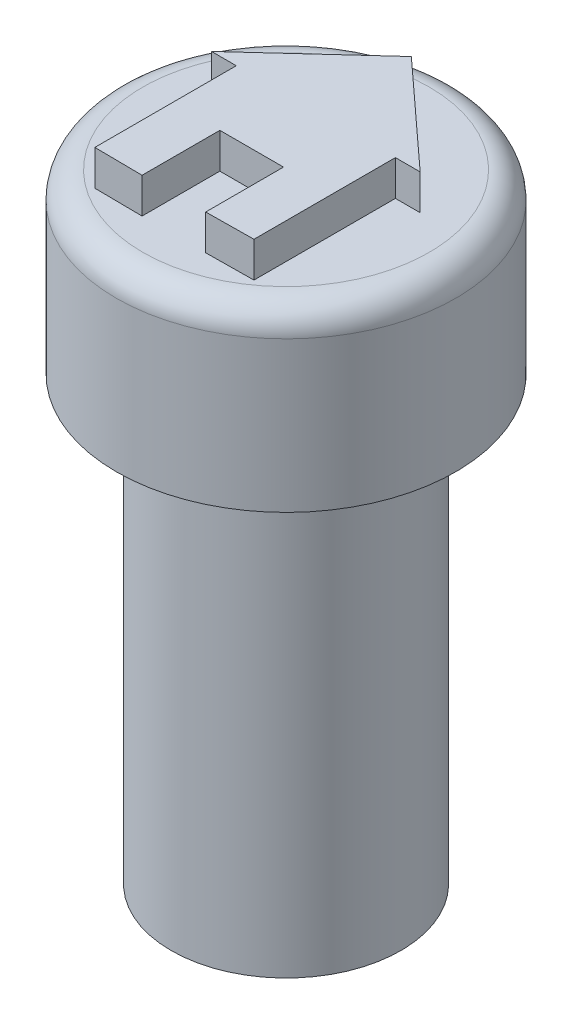
ISO-10303-21;
HEADER;
FILE_DESCRIPTION(('STEP AP214'),'2;1');
FILE_NAME('part.step','',(''),(''),'','','');
FILE_SCHEMA(('AUTOMOTIVE_DESIGN { 1 0 10303 214 1 1 1 1 }'));
ENDSEC;
DATA;
#1=APPLICATION_CONTEXT('core data for automotive mechanical design processes');
#2=APPLICATION_PROTOCOL_DEFINITION('international standard','automotive_design',2000,#1);
#3=PRODUCT_CONTEXT('',#1,'mechanical');
#4=PRODUCT('Part','Part','',(#3));
#5=PRODUCT_RELATED_PRODUCT_CATEGORY('part','',(#4));
#6=PRODUCT_DEFINITION_FORMATION('','',#4);
#7=PRODUCT_DEFINITION_CONTEXT('part definition',#1,'design');
#8=PRODUCT_DEFINITION('design','',#6,#7);
#9=PRODUCT_DEFINITION_SHAPE('','',#8);
#10=(LENGTH_UNIT() NAMED_UNIT(*) SI_UNIT(.MILLI.,.METRE.));
#11=(NAMED_UNIT(*) PLANE_ANGLE_UNIT() SI_UNIT($,.RADIAN.));
#12=(NAMED_UNIT(*) SI_UNIT($,.STERADIAN.) SOLID_ANGLE_UNIT());
#13=UNCERTAINTY_MEASURE_WITH_UNIT(LENGTH_MEASURE(1.E-05),#10,'distance_accuracy_value','');
#14=(GEOMETRIC_REPRESENTATION_CONTEXT(3) GLOBAL_UNCERTAINTY_ASSIGNED_CONTEXT((#13)) GLOBAL_UNIT_ASSIGNED_CONTEXT((#10,
#11,#12)) REPRESENTATION_CONTEXT('',''));
#15=CARTESIAN_POINT('',(0.,0.,0.));
#16=DIRECTION('',(0.,0.,1.));
#17=DIRECTION('',(1.,0.,0.));
#18=AXIS2_PLACEMENT_3D('',#15,#16,#17);
#19=CARTESIAN_POINT('',(0.,12.5,0.));
#20=DIRECTION('',(0.,-1.,0.));
#21=DIRECTION('',(0.,0.,-1.));
#22=AXIS2_PLACEMENT_3D('',#19,#20,#21);
#23=CYLINDRICAL_SURFACE('',#22,3.25);
#24=CARTESIAN_POINT('',(0.,12.5,0.));
#25=DIRECTION('',(0.,1.,0.));
#26=DIRECTION('',(0.,0.,1.));
#27=AXIS2_PLACEMENT_3D('',#24,#25,#26);
#28=CIRCLE('',#27,3.25);
#29=CARTESIAN_POINT('',(0.,12.5,3.25));
#30=VERTEX_POINT('',#29);
#31=EDGE_CURVE('E179',#30,#30,#28,.T.);
#32=ORIENTED_EDGE('',*,*,#31,.F.);
#33=EDGE_LOOP('',(#32));
#34=FACE_BOUND('',#33,.T.);
#35=CARTESIAN_POINT('',(0.,0.,0.));
#36=DIRECTION('',(0.,1.,0.));
#37=DIRECTION('',(0.,0.,1.));
#38=AXIS2_PLACEMENT_3D('',#35,#36,#37);
#39=CIRCLE('',#38,3.25);
#40=CARTESIAN_POINT('',(0.,0.,3.25));
#41=VERTEX_POINT('',#40);
#42=EDGE_CURVE('E176',#41,#41,#39,.T.);
#43=ORIENTED_EDGE('',*,*,#42,.T.);
#44=EDGE_LOOP('',(#43));
#45=FACE_BOUND('',#44,.T.);
#46=ADVANCED_FACE('F61',(#34,#45),#23,.T.);
#47=CARTESIAN_POINT('',(0.,0.,0.));
#48=DIRECTION('',(0.,1.,0.));
#49=DIRECTION('',(0.,0.,1.));
#50=AXIS2_PLACEMENT_3D('',#47,#48,#49);
#51=PLANE('',#50);
#52=CARTESIAN_POINT('',(0.,0.,0.));
#53=DIRECTION('',(0.,-1.,0.));
#54=DIRECTION('',(0.,0.,-1.));
#55=AXIS2_PLACEMENT_3D('',#52,#53,#54);
#56=CIRCLE('',#55,1.75);
#57=CARTESIAN_POINT('',(0.,0.,-1.75));
#58=VERTEX_POINT('',#57);
#59=EDGE_CURVE('E167',#58,#58,#56,.T.);
#60=ORIENTED_EDGE('',*,*,#59,.F.);
#61=EDGE_LOOP('',(#60));
#62=FACE_BOUND('',#61,.T.);
#63=ORIENTED_EDGE('',*,*,#42,.F.);
#64=EDGE_LOOP('',(#63));
#65=FACE_BOUND('',#64,.T.);
#66=ADVANCED_FACE('F198',(#62,#65),#51,.F.);
#67=CARTESIAN_POINT('',(0.,2.5,0.));
#68=DIRECTION('',(0.,-1.,0.));
#69=DIRECTION('',(0.,0.,-1.));
#70=AXIS2_PLACEMENT_3D('',#67,#68,#69);
#71=CYLINDRICAL_SURFACE('',#70,1.75);
#72=CARTESIAN_POINT('',(0.,2.5,0.));
#73=DIRECTION('',(0.,-1.,0.));
#74=DIRECTION('',(0.,0.,-1.));
#75=AXIS2_PLACEMENT_3D('',#72,#73,#74);
#76=CIRCLE('',#75,1.75);
#77=CARTESIAN_POINT('',(0.,2.5,-1.75));
#78=VERTEX_POINT('',#77);
#79=EDGE_CURVE('E173',#78,#78,#76,.T.);
#80=ORIENTED_EDGE('',*,*,#79,.F.);
#81=EDGE_LOOP('',(#80));
#82=FACE_BOUND('',#81,.T.);
#83=ORIENTED_EDGE('',*,*,#59,.T.);
#84=EDGE_LOOP('',(#83));
#85=FACE_BOUND('',#84,.T.);
#86=ADVANCED_FACE('F203',(#82,#85),#71,.F.);
#87=CARTESIAN_POINT('',(0.,2.5,0.));
#88=DIRECTION('',(0.,-1.,0.));
#89=DIRECTION('',(0.,0.,-1.));
#90=AXIS2_PLACEMENT_3D('',#87,#88,#89);
#91=PLANE('',#90);
#92=ORIENTED_EDGE('',*,*,#79,.T.);
#93=EDGE_LOOP('',(#92));
#94=FACE_BOUND('',#93,.T.);
#95=ADVANCED_FACE('F211',(#94),#91,.T.);
#96=CARTESIAN_POINT('',(0.,17.5,0.));
#97=DIRECTION('',(0.,-1.,0.));
#98=DIRECTION('',(0.,0.,-1.));
#99=AXIS2_PLACEMENT_3D('',#96,#97,#98);
#100=CYLINDRICAL_SURFACE('',#99,4.8);
#101=CARTESIAN_POINT('',(0.,16.75,0.));
#102=DIRECTION('',(0.,1.,0.));
#103=DIRECTION('',(0.,0.,1.));
#104=AXIS2_PLACEMENT_3D('',#101,#102,#103);
#105=CIRCLE('',#104,4.8);
#106=CARTESIAN_POINT('',(0.,16.75,4.8));
#107=VERTEX_POINT('',#106);
#108=EDGE_CURVE('E12',#107,#107,#105,.F.);
#109=ORIENTED_EDGE('',*,*,#108,.T.);
#110=EDGE_LOOP('',(#109));
#111=FACE_BOUND('',#110,.T.);
#112=CARTESIAN_POINT('',(0.,12.5,0.));
#113=DIRECTION('',(0.,1.,0.));
#114=DIRECTION('',(0.,0.,1.));
#115=AXIS2_PLACEMENT_3D('',#112,#113,#114);
#116=CIRCLE('',#115,4.8);
#117=CARTESIAN_POINT('',(0.,12.5,4.8));
#118=VERTEX_POINT('',#117);
#119=EDGE_CURVE('E164',#118,#118,#116,.T.);
#120=ORIENTED_EDGE('',*,*,#119,.T.);
#121=EDGE_LOOP('',(#120));
#122=FACE_BOUND('',#121,.T.);
#123=ADVANCED_FACE('F215',(#111,#122),#100,.T.);
#124=CARTESIAN_POINT('',(0.,17.5,0.));
#125=DIRECTION('',(0.,1.,0.));
#126=DIRECTION('',(0.,0.,1.));
#127=AXIS2_PLACEMENT_3D('',#124,#125,#126);
#128=PLANE('',#127);
#129=CARTESIAN_POINT('',(0.,17.5,0.));
#130=DIRECTION('',(0.,1.,0.));
#131=DIRECTION('',(0.,0.,1.));
#132=AXIS2_PLACEMENT_3D('',#129,#130,#131);
#133=CIRCLE('',#132,4.05);
#134=CARTESIAN_POINT('',(0.,17.5,4.05));
#135=VERTEX_POINT('',#134);
#136=EDGE_CURVE('E69',#135,#135,#133,.T.);
#137=ORIENTED_EDGE('',*,*,#136,.T.);
#138=EDGE_LOOP('',(#137));
#139=FACE_BOUND('',#138,.T.);
#140=DIRECTION('',(-0.737672912354375,0.,-0.675158258765021));
#141=VECTOR('',#140,1.);
#142=CARTESIAN_POINT('',(2.95,17.5,-0.842487973796764));
#143=LINE('',#142,#141);
#144=CARTESIAN_POINT('',(2.95,17.5,-0.842487973796764));
#145=VERTEX_POINT('',#144);
#146=CARTESIAN_POINT('',(0.,17.5,-3.54248797379676));
#147=VERTEX_POINT('',#146);
#148=EDGE_CURVE('E76',#145,#147,#143,.T.);
#149=ORIENTED_EDGE('',*,*,#148,.F.);
#150=DIRECTION('',(1.,0.,0.));
#151=VECTOR('',#150,1.);
#152=CARTESIAN_POINT('',(2.25,17.5,-0.842487973796764));
#153=LINE('',#152,#151);
#154=CARTESIAN_POINT('',(2.25,17.5,-0.842487973796764));
#155=VERTEX_POINT('',#154);
#156=EDGE_CURVE('E80',#155,#145,#153,.T.);
#157=ORIENTED_EDGE('',*,*,#156,.F.);
#158=DIRECTION('',(0.,0.,-1.));
#159=VECTOR('',#158,1.);
#160=CARTESIAN_POINT('',(2.25,17.5,3.15751202620324));
#161=LINE('',#160,#159);
#162=CARTESIAN_POINT('',(2.25,17.5,3.15751202620324));
#163=VERTEX_POINT('',#162);
#164=EDGE_CURVE('E269',#163,#155,#161,.T.);
#165=ORIENTED_EDGE('',*,*,#164,.F.);
#166=DIRECTION('',(0.99993946534493,0.,-0.0110029834906805));
#167=VECTOR('',#166,1.);
#168=CARTESIAN_POINT('',(0.9,17.5,3.17236695315353));
#169=LINE('',#168,#167);
#170=CARTESIAN_POINT('',(0.9,17.5,3.17236695315353));
#171=VERTEX_POINT('',#170);
#172=EDGE_CURVE('E321',#171,#163,#169,.T.);
#173=ORIENTED_EDGE('',*,*,#172,.F.);
#174=DIRECTION('',(0.,0.,1.));
#175=VECTOR('',#174,1.);
#176=CARTESIAN_POINT('',(0.9,17.5,0.972366953153534));
#177=LINE('',#176,#175);
#178=CARTESIAN_POINT('',(0.9,17.5,0.972366953153534));
#179=VERTEX_POINT('',#178);
#180=EDGE_CURVE('E318',#179,#171,#177,.T.);
#181=ORIENTED_EDGE('',*,*,#180,.F.);
#182=DIRECTION('',(1.,0.,0.));
#183=VECTOR('',#182,1.);
#184=CARTESIAN_POINT('',(-0.9,17.5,0.972366953153534));
#185=LINE('',#184,#183);
#186=CARTESIAN_POINT('',(-0.9,17.5,0.972366953153534));
#187=VERTEX_POINT('',#186);
#188=EDGE_CURVE('E315',#187,#179,#185,.T.);
#189=ORIENTED_EDGE('',*,*,#188,.F.);
#190=DIRECTION('',(0.,0.,-1.));
#191=VECTOR('',#190,1.);
#192=CARTESIAN_POINT('',(-0.9,17.5,3.17236695315353));
#193=LINE('',#192,#191);
#194=CARTESIAN_POINT('',(-0.9,17.5,3.17236695315353));
#195=VERTEX_POINT('',#194);
#196=EDGE_CURVE('E312',#195,#187,#193,.T.);
#197=ORIENTED_EDGE('',*,*,#196,.F.);
#198=DIRECTION('',(0.99993946534493,0.,0.0110029834906805));
#199=VECTOR('',#198,1.);
#200=CARTESIAN_POINT('',(-2.25,17.5,3.15751202620324));
#201=LINE('',#200,#199);
#202=CARTESIAN_POINT('',(-2.25,17.5,3.15751202620324));
#203=VERTEX_POINT('',#202);
#204=EDGE_CURVE('E305',#203,#195,#201,.T.);
#205=ORIENTED_EDGE('',*,*,#204,.F.);
#206=DIRECTION('',(0.,0.,1.));
#207=VECTOR('',#206,1.);
#208=CARTESIAN_POINT('',(-2.25,17.5,-0.842487973796764));
#209=LINE('',#208,#207);
#210=CARTESIAN_POINT('',(-2.25,17.5,-0.842487973796764));
#211=VERTEX_POINT('',#210);
#212=EDGE_CURVE('E299',#211,#203,#209,.T.);
#213=ORIENTED_EDGE('',*,*,#212,.F.);
#214=DIRECTION('',(1.,0.,0.));
#215=VECTOR('',#214,1.);
#216=CARTESIAN_POINT('',(-2.95,17.5,-0.842487973796764));
#217=LINE('',#216,#215);
#218=CARTESIAN_POINT('',(-2.95,17.5,-0.842487973796764));
#219=VERTEX_POINT('',#218);
#220=EDGE_CURVE('E302',#219,#211,#217,.T.);
#221=ORIENTED_EDGE('',*,*,#220,.F.);
#222=DIRECTION('',(-0.737672912354375,0.,0.675158258765021));
#223=VECTOR('',#222,1.);
#224=CARTESIAN_POINT('',(0.,17.5,-3.54248797379676));
#225=LINE('',#224,#223);
#226=EDGE_CURVE('E303',#147,#219,#225,.T.);
#227=ORIENTED_EDGE('',*,*,#226,.F.);
#228=EDGE_LOOP('',(#149,#157,#165,#173,#181,#189,#197,#205,#213,#221,#227));
#229=FACE_BOUND('',#228,.T.);
#230=ADVANCED_FACE('F186',(#139,#229),#128,.T.);
#231=CARTESIAN_POINT('',(0.,12.5,0.));
#232=DIRECTION('',(0.,1.,0.));
#233=DIRECTION('',(0.,0.,1.));
#234=AXIS2_PLACEMENT_3D('',#231,#232,#233);
#235=PLANE('',#234);
#236=ORIENTED_EDGE('',*,*,#31,.T.);
#237=EDGE_LOOP('',(#236));
#238=FACE_BOUND('',#237,.T.);
#239=ORIENTED_EDGE('',*,*,#119,.F.);
#240=EDGE_LOOP('',(#239));
#241=FACE_BOUND('',#240,.T.);
#242=ADVANCED_FACE('F220',(#238,#241),#235,.F.);
#243=CARTESIAN_POINT('',(2.95,18.5,-0.842487973796764));
#244=DIRECTION('',(-0.675158258765021,0.,0.737672912354375));
#245=DIRECTION('',(0.737672912354375,0.,0.675158258765021));
#246=AXIS2_PLACEMENT_3D('',#243,#244,#245);
#247=PLANE('',#246);
#248=ORIENTED_EDGE('',*,*,#148,.T.);
#249=DIRECTION('',(0.,-1.,0.));
#250=VECTOR('',#249,1.);
#251=CARTESIAN_POINT('',(0.,18.5,-3.54248797379676));
#252=LINE('',#251,#250);
#253=CARTESIAN_POINT('',(0.,18.5,-3.54248797379676));
#254=VERTEX_POINT('',#253);
#255=EDGE_CURVE('E147',#254,#147,#252,.T.);
#256=ORIENTED_EDGE('',*,*,#255,.F.);
#257=DIRECTION('',(-0.737672912354375,0.,-0.675158258765021));
#258=VECTOR('',#257,1.);
#259=CARTESIAN_POINT('',(2.95,18.5,-0.842487973796764));
#260=LINE('',#259,#258);
#261=CARTESIAN_POINT('',(2.95,18.5,-0.842487973796764));
#262=VERTEX_POINT('',#261);
#263=EDGE_CURVE('E153',#262,#254,#260,.T.);
#264=ORIENTED_EDGE('',*,*,#263,.F.);
#265=DIRECTION('',(0.,-1.,0.));
#266=VECTOR('',#265,1.);
#267=CARTESIAN_POINT('',(2.95,18.5,-0.842487973796764));
#268=LINE('',#267,#266);
#269=EDGE_CURVE('E266',#262,#145,#268,.T.);
#270=ORIENTED_EDGE('',*,*,#269,.T.);
#271=EDGE_LOOP('',(#248,#256,#264,#270));
#272=FACE_BOUND('',#271,.T.);
#273=ADVANCED_FACE('F163',(#272),#247,.F.);
#274=CARTESIAN_POINT('',(0.,18.5,-3.54248797379676));
#275=DIRECTION('',(0.675158258765021,0.,0.737672912354375));
#276=DIRECTION('',(0.737672912354375,0.,-0.675158258765021));
#277=AXIS2_PLACEMENT_3D('',#274,#275,#276);
#278=PLANE('',#277);
#279=ORIENTED_EDGE('',*,*,#226,.T.);
#280=DIRECTION('',(0.,-1.,0.));
#281=VECTOR('',#280,1.);
#282=CARTESIAN_POINT('',(-2.95,18.5,-0.842487973796764));
#283=LINE('',#282,#281);
#284=CARTESIAN_POINT('',(-2.95,18.5,-0.842487973796764));
#285=VERTEX_POINT('',#284);
#286=EDGE_CURVE('E149',#285,#219,#283,.T.);
#287=ORIENTED_EDGE('',*,*,#286,.F.);
#288=DIRECTION('',(-0.737672912354375,0.,0.675158258765021));
#289=VECTOR('',#288,1.);
#290=CARTESIAN_POINT('',(0.,18.5,-3.54248797379676));
#291=LINE('',#290,#289);
#292=EDGE_CURVE('E142',#254,#285,#291,.T.);
#293=ORIENTED_EDGE('',*,*,#292,.F.);
#294=ORIENTED_EDGE('',*,*,#255,.T.);
#295=EDGE_LOOP('',(#279,#287,#293,#294));
#296=FACE_BOUND('',#295,.T.);
#297=ADVANCED_FACE('F145',(#296),#278,.F.);
#298=CARTESIAN_POINT('',(-2.95,18.5,-0.842487973796764));
#299=DIRECTION('',(0.,0.,-1.));
#300=DIRECTION('',(-1.,0.,0.));
#301=AXIS2_PLACEMENT_3D('',#298,#299,#300);
#302=PLANE('',#301);
#303=ORIENTED_EDGE('',*,*,#220,.T.);
#304=DIRECTION('',(0.,-1.,0.));
#305=VECTOR('',#304,1.);
#306=CARTESIAN_POINT('',(-2.25,18.5,-0.842487973796764));
#307=LINE('',#306,#305);
#308=CARTESIAN_POINT('',(-2.25,18.5,-0.842487973796764));
#309=VERTEX_POINT('',#308);
#310=EDGE_CURVE('E169',#309,#211,#307,.T.);
#311=ORIENTED_EDGE('',*,*,#310,.F.);
#312=DIRECTION('',(1.,0.,0.));
#313=VECTOR('',#312,1.);
#314=CARTESIAN_POINT('',(-2.95,18.5,-0.842487973796764));
#315=LINE('',#314,#313);
#316=EDGE_CURVE('E152',#285,#309,#315,.T.);
#317=ORIENTED_EDGE('',*,*,#316,.F.);
#318=ORIENTED_EDGE('',*,*,#286,.T.);
#319=EDGE_LOOP('',(#303,#311,#317,#318));
#320=FACE_BOUND('',#319,.T.);
#321=ADVANCED_FACE('F229',(#320),#302,.F.);
#322=CARTESIAN_POINT('',(-2.25,18.5,-0.842487973796764));
#323=DIRECTION('',(1.,0.,0.));
#324=DIRECTION('',(0.,0.,-1.));
#325=AXIS2_PLACEMENT_3D('',#322,#323,#324);
#326=PLANE('',#325);
#327=ORIENTED_EDGE('',*,*,#212,.T.);
#328=DIRECTION('',(0.,-1.,0.));
#329=VECTOR('',#328,1.);
#330=CARTESIAN_POINT('',(-2.25,18.5,3.15751202620324));
#331=LINE('',#330,#329);
#332=CARTESIAN_POINT('',(-2.25,18.5,3.15751202620324));
#333=VERTEX_POINT('',#332);
#334=EDGE_CURVE('E292',#333,#203,#331,.T.);
#335=ORIENTED_EDGE('',*,*,#334,.F.);
#336=DIRECTION('',(0.,0.,1.));
#337=VECTOR('',#336,1.);
#338=CARTESIAN_POINT('',(-2.25,18.5,-0.842487973796764));
#339=LINE('',#338,#337);
#340=EDGE_CURVE('E300',#309,#333,#339,.T.);
#341=ORIENTED_EDGE('',*,*,#340,.F.);
#342=ORIENTED_EDGE('',*,*,#310,.T.);
#343=EDGE_LOOP('',(#327,#335,#341,#342));
#344=FACE_BOUND('',#343,.T.);
#345=ADVANCED_FACE('F232',(#344),#326,.F.);
#346=CARTESIAN_POINT('',(-2.25,18.5,3.15751202620324));
#347=DIRECTION('',(0.0110029834906805,0.,-0.99993946534493));
#348=DIRECTION('',(-0.99993946534493,0.,-0.0110029834906805));
#349=AXIS2_PLACEMENT_3D('',#346,#347,#348);
#350=PLANE('',#349);
#351=ORIENTED_EDGE('',*,*,#204,.T.);
#352=DIRECTION('',(0.,-1.,0.));
#353=VECTOR('',#352,1.);
#354=CARTESIAN_POINT('',(-0.9,18.5,3.17236695315353));
#355=LINE('',#354,#353);
#356=CARTESIAN_POINT('',(-0.9,18.5,3.17236695315353));
#357=VERTEX_POINT('',#356);
#358=EDGE_CURVE('E289',#357,#195,#355,.T.);
#359=ORIENTED_EDGE('',*,*,#358,.F.);
#360=DIRECTION('',(0.99993946534493,0.,0.0110029834906805));
#361=VECTOR('',#360,1.);
#362=CARTESIAN_POINT('',(-2.25,18.5,3.15751202620324));
#363=LINE('',#362,#361);
#364=EDGE_CURVE('E338',#333,#357,#363,.T.);
#365=ORIENTED_EDGE('',*,*,#364,.F.);
#366=ORIENTED_EDGE('',*,*,#334,.T.);
#367=EDGE_LOOP('',(#351,#359,#365,#366));
#368=FACE_BOUND('',#367,.T.);
#369=ADVANCED_FACE('F236',(#368),#350,.F.);
#370=CARTESIAN_POINT('',(-0.9,18.5,3.17236695315353));
#371=DIRECTION('',(-1.,0.,0.));
#372=DIRECTION('',(0.,0.,1.));
#373=AXIS2_PLACEMENT_3D('',#370,#371,#372);
#374=PLANE('',#373);
#375=ORIENTED_EDGE('',*,*,#196,.T.);
#376=DIRECTION('',(0.,-1.,0.));
#377=VECTOR('',#376,1.);
#378=CARTESIAN_POINT('',(-0.9,18.5,0.972366953153534));
#379=LINE('',#378,#377);
#380=CARTESIAN_POINT('',(-0.9,18.5,0.972366953153534));
#381=VERTEX_POINT('',#380);
#382=EDGE_CURVE('E286',#381,#187,#379,.T.);
#383=ORIENTED_EDGE('',*,*,#382,.F.);
#384=DIRECTION('',(0.,0.,-1.));
#385=VECTOR('',#384,1.);
#386=CARTESIAN_POINT('',(-0.9,18.5,3.17236695315353));
#387=LINE('',#386,#385);
#388=EDGE_CURVE('E335',#357,#381,#387,.T.);
#389=ORIENTED_EDGE('',*,*,#388,.F.);
#390=ORIENTED_EDGE('',*,*,#358,.T.);
#391=EDGE_LOOP('',(#375,#383,#389,#390));
#392=FACE_BOUND('',#391,.T.);
#393=ADVANCED_FACE('F240',(#392),#374,.F.);
#394=CARTESIAN_POINT('',(-0.9,18.5,0.972366953153534));
#395=DIRECTION('',(0.,0.,-1.));
#396=DIRECTION('',(-1.,0.,0.));
#397=AXIS2_PLACEMENT_3D('',#394,#395,#396);
#398=PLANE('',#397);
#399=ORIENTED_EDGE('',*,*,#188,.T.);
#400=DIRECTION('',(0.,-1.,0.));
#401=VECTOR('',#400,1.);
#402=CARTESIAN_POINT('',(0.9,18.5,0.972366953153534));
#403=LINE('',#402,#401);
#404=CARTESIAN_POINT('',(0.9,18.5,0.972366953153534));
#405=VERTEX_POINT('',#404);
#406=EDGE_CURVE('E283',#405,#179,#403,.T.);
#407=ORIENTED_EDGE('',*,*,#406,.F.);
#408=DIRECTION('',(1.,0.,0.));
#409=VECTOR('',#408,1.);
#410=CARTESIAN_POINT('',(-0.9,18.5,0.972366953153534));
#411=LINE('',#410,#409);
#412=EDGE_CURVE('E333',#381,#405,#411,.T.);
#413=ORIENTED_EDGE('',*,*,#412,.F.);
#414=ORIENTED_EDGE('',*,*,#382,.T.);
#415=EDGE_LOOP('',(#399,#407,#413,#414));
#416=FACE_BOUND('',#415,.T.);
#417=ADVANCED_FACE('F244',(#416),#398,.F.);
#418=CARTESIAN_POINT('',(0.9,18.5,0.972366953153534));
#419=DIRECTION('',(1.,0.,0.));
#420=DIRECTION('',(0.,0.,-1.));
#421=AXIS2_PLACEMENT_3D('',#418,#419,#420);
#422=PLANE('',#421);
#423=ORIENTED_EDGE('',*,*,#180,.T.);
#424=DIRECTION('',(0.,-1.,0.));
#425=VECTOR('',#424,1.);
#426=CARTESIAN_POINT('',(0.9,18.5,3.17236695315353));
#427=LINE('',#426,#425);
#428=CARTESIAN_POINT('',(0.9,18.5,3.17236695315353));
#429=VERTEX_POINT('',#428);
#430=EDGE_CURVE('E280',#429,#171,#427,.T.);
#431=ORIENTED_EDGE('',*,*,#430,.F.);
#432=DIRECTION('',(0.,0.,1.));
#433=VECTOR('',#432,1.);
#434=CARTESIAN_POINT('',(0.9,18.5,0.972366953153534));
#435=LINE('',#434,#433);
#436=EDGE_CURVE('E329',#405,#429,#435,.T.);
#437=ORIENTED_EDGE('',*,*,#436,.F.);
#438=ORIENTED_EDGE('',*,*,#406,.T.);
#439=EDGE_LOOP('',(#423,#431,#437,#438));
#440=FACE_BOUND('',#439,.T.);
#441=ADVANCED_FACE('F248',(#440),#422,.F.);
#442=CARTESIAN_POINT('',(0.9,18.5,3.17236695315353));
#443=DIRECTION('',(-0.0110029834906805,0.,-0.99993946534493));
#444=DIRECTION('',(-0.99993946534493,0.,0.0110029834906805));
#445=AXIS2_PLACEMENT_3D('',#442,#443,#444);
#446=PLANE('',#445);
#447=ORIENTED_EDGE('',*,*,#172,.T.);
#448=DIRECTION('',(0.,-1.,0.));
#449=VECTOR('',#448,1.);
#450=CARTESIAN_POINT('',(2.25,18.5,3.15751202620324));
#451=LINE('',#450,#449);
#452=CARTESIAN_POINT('',(2.25,18.5,3.15751202620324));
#453=VERTEX_POINT('',#452);
#454=EDGE_CURVE('E272',#453,#163,#451,.T.);
#455=ORIENTED_EDGE('',*,*,#454,.F.);
#456=DIRECTION('',(0.99993946534493,0.,-0.0110029834906805));
#457=VECTOR('',#456,1.);
#458=CARTESIAN_POINT('',(0.9,18.5,3.17236695315353));
#459=LINE('',#458,#457);
#460=EDGE_CURVE('E327',#429,#453,#459,.T.);
#461=ORIENTED_EDGE('',*,*,#460,.F.);
#462=ORIENTED_EDGE('',*,*,#430,.T.);
#463=EDGE_LOOP('',(#447,#455,#461,#462));
#464=FACE_BOUND('',#463,.T.);
#465=ADVANCED_FACE('F252',(#464),#446,.F.);
#466=CARTESIAN_POINT('',(2.25,18.5,3.15751202620324));
#467=DIRECTION('',(-1.,0.,0.));
#468=DIRECTION('',(0.,0.,1.));
#469=AXIS2_PLACEMENT_3D('',#466,#467,#468);
#470=PLANE('',#469);
#471=ORIENTED_EDGE('',*,*,#164,.T.);
#472=DIRECTION('',(0.,-1.,0.));
#473=VECTOR('',#472,1.);
#474=CARTESIAN_POINT('',(2.25,18.5,-0.842487973796764));
#475=LINE('',#474,#473);
#476=CARTESIAN_POINT('',(2.25,18.5,-0.842487973796764));
#477=VERTEX_POINT('',#476);
#478=EDGE_CURVE('E268',#477,#155,#475,.T.);
#479=ORIENTED_EDGE('',*,*,#478,.F.);
#480=DIRECTION('',(0.,0.,-1.));
#481=VECTOR('',#480,1.);
#482=CARTESIAN_POINT('',(2.25,18.5,3.15751202620324));
#483=LINE('',#482,#481);
#484=EDGE_CURVE('E274',#453,#477,#483,.T.);
#485=ORIENTED_EDGE('',*,*,#484,.F.);
#486=ORIENTED_EDGE('',*,*,#454,.T.);
#487=EDGE_LOOP('',(#471,#479,#485,#486));
#488=FACE_BOUND('',#487,.T.);
#489=ADVANCED_FACE('F256',(#488),#470,.F.);
#490=CARTESIAN_POINT('',(2.25,18.5,-0.842487973796764));
#491=DIRECTION('',(0.,0.,-1.));
#492=DIRECTION('',(-1.,0.,0.));
#493=AXIS2_PLACEMENT_3D('',#490,#491,#492);
#494=PLANE('',#493);
#495=ORIENTED_EDGE('',*,*,#156,.T.);
#496=ORIENTED_EDGE('',*,*,#269,.F.);
#497=DIRECTION('',(1.,0.,0.));
#498=VECTOR('',#497,1.);
#499=CARTESIAN_POINT('',(2.25,18.5,-0.842487973796764));
#500=LINE('',#499,#498);
#501=EDGE_CURVE('E158',#477,#262,#500,.T.);
#502=ORIENTED_EDGE('',*,*,#501,.F.);
#503=ORIENTED_EDGE('',*,*,#478,.T.);
#504=EDGE_LOOP('',(#495,#496,#502,#503));
#505=FACE_BOUND('',#504,.T.);
#506=ADVANCED_FACE('F194',(#505),#494,.F.);
#507=CARTESIAN_POINT('',(0.,18.5,0.));
#508=DIRECTION('',(0.,1.,0.));
#509=DIRECTION('',(0.,0.,1.));
#510=AXIS2_PLACEMENT_3D('',#507,#508,#509);
#511=PLANE('',#510);
#512=ORIENTED_EDGE('',*,*,#263,.T.);
#513=ORIENTED_EDGE('',*,*,#292,.T.);
#514=ORIENTED_EDGE('',*,*,#316,.T.);
#515=ORIENTED_EDGE('',*,*,#340,.T.);
#516=ORIENTED_EDGE('',*,*,#364,.T.);
#517=ORIENTED_EDGE('',*,*,#388,.T.);
#518=ORIENTED_EDGE('',*,*,#412,.T.);
#519=ORIENTED_EDGE('',*,*,#436,.T.);
#520=ORIENTED_EDGE('',*,*,#460,.T.);
#521=ORIENTED_EDGE('',*,*,#484,.T.);
#522=ORIENTED_EDGE('',*,*,#501,.T.);
#523=EDGE_LOOP('',(#512,#513,#514,#515,#516,#517,#518,#519,#520,#521,#522));
#524=FACE_BOUND('',#523,.T.);
#525=ADVANCED_FACE('F156',(#524),#511,.T.);
#526=CARTESIAN_POINT('',(0.,16.75,0.));
#527=DIRECTION('',(0.,1.,0.));
#528=DIRECTION('',(0.,0.,1.));
#529=AXIS2_PLACEMENT_3D('',#526,#527,#528);
#530=TOROIDAL_SURFACE('',#529,4.05,0.75);
#531=ORIENTED_EDGE('',*,*,#108,.F.);
#532=EDGE_LOOP('',(#531));
#533=FACE_BOUND('',#532,.T.);
#534=ORIENTED_EDGE('',*,*,#136,.F.);
#535=EDGE_LOOP('',(#534));
#536=FACE_BOUND('',#535,.T.);
#537=ADVANCED_FACE('F63',(#533,#536),#530,.T.);
#538=CLOSED_SHELL('',(#46,#66,#86,#95,#123,#230,#242,#273,#297,#321,#345,#369,#393,#417,#441,
#465,#489,#506,#525,#537));
#539=MANIFOLD_SOLID_BREP('B2',#538);
#540=ADVANCED_BREP_SHAPE_REPRESENTATION('',(#18,#539),#14);
#541=SHAPE_DEFINITION_REPRESENTATION(#9,#540);
ENDSEC;
END-ISO-10303-21;
